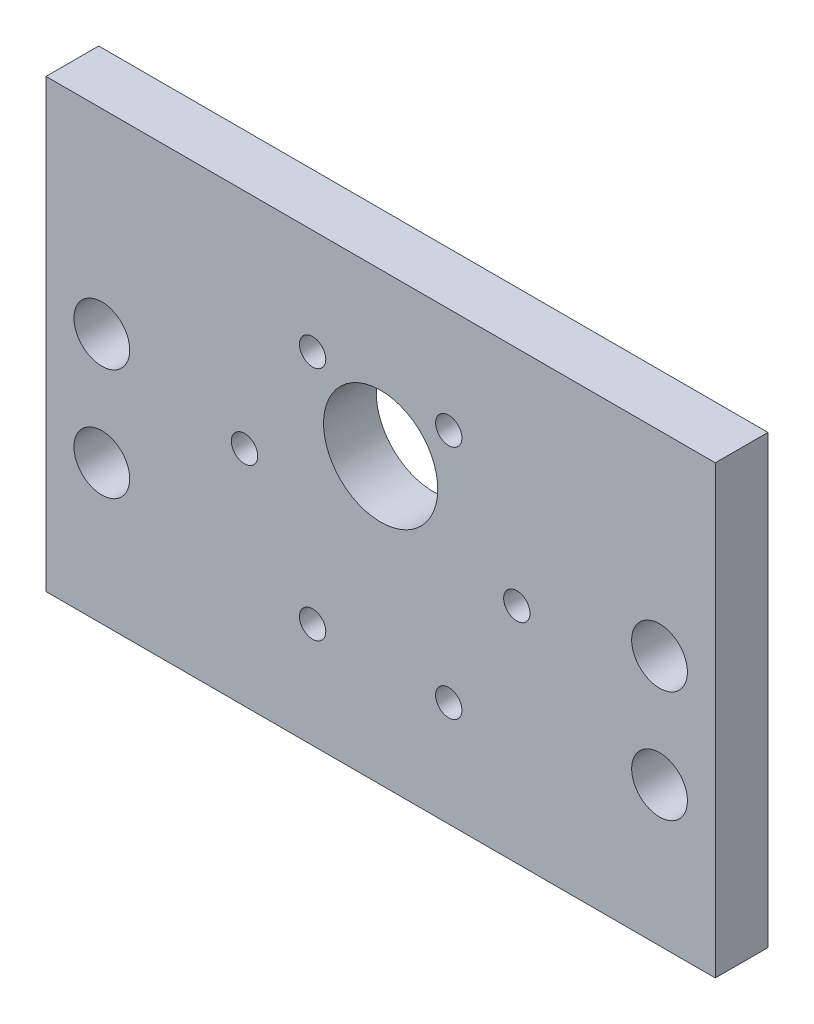
ISO-10303-21;
HEADER;
FILE_DESCRIPTION(('STEP AP214'),'2;1');
FILE_NAME('part.step','',(''),(''),'','','');
FILE_SCHEMA(('AUTOMOTIVE_DESIGN { 1 0 10303 214 1 1 1 1 }'));
ENDSEC;
DATA;
#1=APPLICATION_CONTEXT('core data for automotive mechanical design processes');
#2=APPLICATION_PROTOCOL_DEFINITION('international standard','automotive_design',2000,#1);
#3=PRODUCT_CONTEXT('',#1,'mechanical');
#4=PRODUCT('Part','Part','',(#3));
#5=PRODUCT_RELATED_PRODUCT_CATEGORY('part','',(#4));
#6=PRODUCT_DEFINITION_FORMATION('','',#4);
#7=PRODUCT_DEFINITION_CONTEXT('part definition',#1,'design');
#8=PRODUCT_DEFINITION('design','',#6,#7);
#9=PRODUCT_DEFINITION_SHAPE('','',#8);
#10=(LENGTH_UNIT() NAMED_UNIT(*) SI_UNIT(.MILLI.,.METRE.));
#11=(NAMED_UNIT(*) PLANE_ANGLE_UNIT() SI_UNIT($,.RADIAN.));
#12=(NAMED_UNIT(*) SI_UNIT($,.STERADIAN.) SOLID_ANGLE_UNIT());
#13=UNCERTAINTY_MEASURE_WITH_UNIT(LENGTH_MEASURE(1.E-05),#10,'distance_accuracy_value','');
#14=(GEOMETRIC_REPRESENTATION_CONTEXT(3) GLOBAL_UNCERTAINTY_ASSIGNED_CONTEXT((#13)) GLOBAL_UNIT_ASSIGNED_CONTEXT((#10,
#11,#12)) REPRESENTATION_CONTEXT('',''));
#15=CARTESIAN_POINT('',(0.,0.,0.));
#16=DIRECTION('',(0.,0.,1.));
#17=DIRECTION('',(1.,0.,0.));
#18=AXIS2_PLACEMENT_3D('',#15,#16,#17);
#19=CARTESIAN_POINT('',(0.,0.,5.9944));
#20=DIRECTION('',(0.,0.,-1.));
#21=DIRECTION('',(-1.,0.,0.));
#22=AXIS2_PLACEMENT_3D('',#19,#20,#21);
#23=PLANE('',#22);
#24=CARTESIAN_POINT('',(69.85,28.575,5.9944));
#25=DIRECTION('',(0.,0.,1.));
#26=DIRECTION('',(1.,0.,0.));
#27=AXIS2_PLACEMENT_3D('',#24,#25,#26);
#28=CIRCLE('',#27,3.175);
#29=CARTESIAN_POINT('',(73.025,28.575,5.9944));
#30=VERTEX_POINT('',#29);
#31=EDGE_CURVE('E164',#30,#30,#28,.T.);
#32=ORIENTED_EDGE('',*,*,#31,.F.);
#33=EDGE_LOOP('',(#32));
#34=FACE_BOUND('',#33,.T.);
#35=CARTESIAN_POINT('',(45.85,38.8233937586588,5.9944));
#36=DIRECTION('',(0.,0.,1.));
#37=DIRECTION('',(1.,0.,0.));
#38=AXIS2_PLACEMENT_3D('',#35,#36,#37);
#39=CIRCLE('',#38,1.50000000000001);
#40=CARTESIAN_POINT('',(47.35,38.8233937586588,5.9944));
#41=VERTEX_POINT('',#40);
#42=EDGE_CURVE('E152',#41,#41,#39,.T.);
#43=ORIENTED_EDGE('',*,*,#42,.F.);
#44=EDGE_LOOP('',(#43));
#45=FACE_BOUND('',#44,.T.);
#46=CARTESIAN_POINT('',(30.35,11.9766062413412,5.9944));
#47=DIRECTION('',(0.,0.,1.));
#48=DIRECTION('',(1.,0.,0.));
#49=AXIS2_PLACEMENT_3D('',#46,#47,#48);
#50=CIRCLE('',#49,1.50000000000001);
#51=CARTESIAN_POINT('',(31.85,11.9766062413412,5.9944));
#52=VERTEX_POINT('',#51);
#53=EDGE_CURVE('E140',#52,#52,#50,.T.);
#54=ORIENTED_EDGE('',*,*,#53,.F.);
#55=EDGE_LOOP('',(#54));
#56=FACE_BOUND('',#55,.T.);
#57=CARTESIAN_POINT('',(53.6,25.4,5.9944));
#58=DIRECTION('',(0.,0.,1.));
#59=DIRECTION('',(1.,0.,0.));
#60=AXIS2_PLACEMENT_3D('',#57,#58,#59);
#61=CIRCLE('',#60,1.5);
#62=CARTESIAN_POINT('',(55.1,25.4,5.9944));
#63=VERTEX_POINT('',#62);
#64=EDGE_CURVE('E128',#63,#63,#61,.T.);
#65=ORIENTED_EDGE('',*,*,#64,.F.);
#66=EDGE_LOOP('',(#65));
#67=FACE_BOUND('',#66,.T.);
#68=CARTESIAN_POINT('',(38.1,32.4,5.9944));
#69=DIRECTION('',(0.,0.,1.));
#70=DIRECTION('',(1.,0.,0.));
#71=AXIS2_PLACEMENT_3D('',#68,#69,#70);
#72=CIRCLE('',#71,6.50000000000002);
#73=CARTESIAN_POINT('',(44.6,32.4,5.9944));
#74=VERTEX_POINT('',#73);
#75=EDGE_CURVE('E116',#74,#74,#72,.T.);
#76=ORIENTED_EDGE('',*,*,#75,.F.);
#77=EDGE_LOOP('',(#76));
#78=FACE_BOUND('',#77,.T.);
#79=DIRECTION('',(0.,-1.,0.));
#80=VECTOR('',#79,1.);
#81=CARTESIAN_POINT('',(0.,0.,5.9944));
#82=LINE('',#81,#80);
#83=CARTESIAN_POINT('',(0.,50.8,5.9944));
#84=VERTEX_POINT('',#83);
#85=CARTESIAN_POINT('',(0.,0.,5.9944));
#86=VERTEX_POINT('',#85);
#87=EDGE_CURVE('E86',#84,#86,#82,.T.);
#88=ORIENTED_EDGE('',*,*,#87,.T.);
#89=DIRECTION('',(1.,0.,0.));
#90=VECTOR('',#89,1.);
#91=CARTESIAN_POINT('',(0.,0.,5.9944));
#92=LINE('',#91,#90);
#93=CARTESIAN_POINT('',(76.2,0.,5.9944));
#94=VERTEX_POINT('',#93);
#95=EDGE_CURVE('E81',#86,#94,#92,.T.);
#96=ORIENTED_EDGE('',*,*,#95,.T.);
#97=DIRECTION('',(0.,1.,0.));
#98=VECTOR('',#97,1.);
#99=CARTESIAN_POINT('',(76.2,0.,5.9944));
#100=LINE('',#99,#98);
#101=CARTESIAN_POINT('',(76.2,50.8,5.9944));
#102=VERTEX_POINT('',#101);
#103=EDGE_CURVE('E84',#94,#102,#100,.T.);
#104=ORIENTED_EDGE('',*,*,#103,.T.);
#105=DIRECTION('',(-1.,0.,0.));
#106=VECTOR('',#105,1.);
#107=CARTESIAN_POINT('',(0.,50.8,5.9944));
#108=LINE('',#107,#106);
#109=EDGE_CURVE('E51',#102,#84,#108,.T.);
#110=ORIENTED_EDGE('',*,*,#109,.T.);
#111=EDGE_LOOP('',(#88,#96,#104,#110));
#112=FACE_BOUND('',#111,.T.);
#113=CARTESIAN_POINT('',(6.35,28.575,5.9944));
#114=DIRECTION('',(0.,0.,1.));
#115=DIRECTION('',(1.,0.,0.));
#116=AXIS2_PLACEMENT_3D('',#113,#114,#115);
#117=CIRCLE('',#116,3.175);
#118=CARTESIAN_POINT('',(9.525,28.575,5.9944));
#119=VERTEX_POINT('',#118);
#120=EDGE_CURVE('E101',#119,#119,#117,.T.);
#121=ORIENTED_EDGE('',*,*,#120,.F.);
#122=EDGE_LOOP('',(#121));
#123=FACE_BOUND('',#122,.T.);
#124=CARTESIAN_POINT('',(22.6,25.4,5.9944));
#125=DIRECTION('',(0.,0.,1.));
#126=DIRECTION('',(1.,0.,0.));
#127=AXIS2_PLACEMENT_3D('',#124,#125,#126);
#128=CIRCLE('',#127,1.5);
#129=CARTESIAN_POINT('',(24.1,25.4,5.9944));
#130=VERTEX_POINT('',#129);
#131=EDGE_CURVE('E122',#130,#130,#128,.T.);
#132=ORIENTED_EDGE('',*,*,#131,.F.);
#133=EDGE_LOOP('',(#132));
#134=FACE_BOUND('',#133,.T.);
#135=CARTESIAN_POINT('',(45.85,11.9766062413412,5.9944));
#136=DIRECTION('',(0.,0.,1.));
#137=DIRECTION('',(1.,0.,0.));
#138=AXIS2_PLACEMENT_3D('',#135,#136,#137);
#139=CIRCLE('',#138,1.5);
#140=CARTESIAN_POINT('',(47.35,11.9766062413412,5.9944));
#141=VERTEX_POINT('',#140);
#142=EDGE_CURVE('E134',#141,#141,#139,.T.);
#143=ORIENTED_EDGE('',*,*,#142,.F.);
#144=EDGE_LOOP('',(#143));
#145=FACE_BOUND('',#144,.T.);
#146=CARTESIAN_POINT('',(30.35,38.8233937586588,5.9944));
#147=DIRECTION('',(0.,0.,1.));
#148=DIRECTION('',(1.,0.,0.));
#149=AXIS2_PLACEMENT_3D('',#146,#147,#148);
#150=CIRCLE('',#149,1.50000000000001);
#151=CARTESIAN_POINT('',(31.85,38.8233937586588,5.9944));
#152=VERTEX_POINT('',#151);
#153=EDGE_CURVE('E146',#152,#152,#150,.T.);
#154=ORIENTED_EDGE('',*,*,#153,.F.);
#155=EDGE_LOOP('',(#154));
#156=FACE_BOUND('',#155,.T.);
#157=CARTESIAN_POINT('',(6.35,15.875,5.9944));
#158=DIRECTION('',(0.,0.,1.));
#159=DIRECTION('',(1.,0.,0.));
#160=AXIS2_PLACEMENT_3D('',#157,#158,#159);
#161=CIRCLE('',#160,3.175);
#162=CARTESIAN_POINT('',(9.525,15.875,5.9944));
#163=VERTEX_POINT('',#162);
#164=EDGE_CURVE('E158',#163,#163,#161,.T.);
#165=ORIENTED_EDGE('',*,*,#164,.F.);
#166=EDGE_LOOP('',(#165));
#167=FACE_BOUND('',#166,.T.);
#168=CARTESIAN_POINT('',(69.85,15.875,5.9944));
#169=DIRECTION('',(0.,0.,1.));
#170=DIRECTION('',(1.,0.,0.));
#171=AXIS2_PLACEMENT_3D('',#168,#169,#170);
#172=CIRCLE('',#171,3.175);
#173=CARTESIAN_POINT('',(73.025,15.875,5.9944));
#174=VERTEX_POINT('',#173);
#175=EDGE_CURVE('E170',#174,#174,#172,.T.);
#176=ORIENTED_EDGE('',*,*,#175,.F.);
#177=EDGE_LOOP('',(#176));
#178=FACE_BOUND('',#177,.T.);
#179=ADVANCED_FACE('F34',(#34,#45,#56,#67,#78,#112,#123,#134,#145,#156,#167,#178),#23,.F.);
#180=CARTESIAN_POINT('',(0.,0.,0.));
#181=DIRECTION('',(0.,0.,-1.));
#182=DIRECTION('',(-1.,0.,0.));
#183=AXIS2_PLACEMENT_3D('',#180,#181,#182);
#184=PLANE('',#183);
#185=CARTESIAN_POINT('',(69.85,28.575,0.));
#186=DIRECTION('',(0.,0.,1.));
#187=DIRECTION('',(1.,0.,0.));
#188=AXIS2_PLACEMENT_3D('',#185,#186,#187);
#189=CIRCLE('',#188,3.175);
#190=CARTESIAN_POINT('',(73.025,28.575,0.));
#191=VERTEX_POINT('',#190);
#192=EDGE_CURVE('E167',#191,#191,#189,.T.);
#193=ORIENTED_EDGE('',*,*,#192,.T.);
#194=EDGE_LOOP('',(#193));
#195=FACE_BOUND('',#194,.T.);
#196=CARTESIAN_POINT('',(45.85,38.8233937586588,0.));
#197=DIRECTION('',(0.,0.,1.));
#198=DIRECTION('',(1.,0.,0.));
#199=AXIS2_PLACEMENT_3D('',#196,#197,#198);
#200=CIRCLE('',#199,1.50000000000001);
#201=CARTESIAN_POINT('',(47.35,38.8233937586588,0.));
#202=VERTEX_POINT('',#201);
#203=EDGE_CURVE('E155',#202,#202,#200,.T.);
#204=ORIENTED_EDGE('',*,*,#203,.T.);
#205=EDGE_LOOP('',(#204));
#206=FACE_BOUND('',#205,.T.);
#207=CARTESIAN_POINT('',(30.35,11.9766062413412,0.));
#208=DIRECTION('',(0.,0.,1.));
#209=DIRECTION('',(1.,0.,0.));
#210=AXIS2_PLACEMENT_3D('',#207,#208,#209);
#211=CIRCLE('',#210,1.50000000000001);
#212=CARTESIAN_POINT('',(31.85,11.9766062413412,0.));
#213=VERTEX_POINT('',#212);
#214=EDGE_CURVE('E143',#213,#213,#211,.T.);
#215=ORIENTED_EDGE('',*,*,#214,.T.);
#216=EDGE_LOOP('',(#215));
#217=FACE_BOUND('',#216,.T.);
#218=CARTESIAN_POINT('',(53.6,25.4,0.));
#219=DIRECTION('',(0.,0.,1.));
#220=DIRECTION('',(1.,0.,0.));
#221=AXIS2_PLACEMENT_3D('',#218,#219,#220);
#222=CIRCLE('',#221,1.5);
#223=CARTESIAN_POINT('',(55.1,25.4,0.));
#224=VERTEX_POINT('',#223);
#225=EDGE_CURVE('E131',#224,#224,#222,.T.);
#226=ORIENTED_EDGE('',*,*,#225,.T.);
#227=EDGE_LOOP('',(#226));
#228=FACE_BOUND('',#227,.T.);
#229=CARTESIAN_POINT('',(38.1,32.4,0.));
#230=DIRECTION('',(0.,0.,1.));
#231=DIRECTION('',(1.,0.,0.));
#232=AXIS2_PLACEMENT_3D('',#229,#230,#231);
#233=CIRCLE('',#232,6.50000000000002);
#234=CARTESIAN_POINT('',(44.6,32.4,0.));
#235=VERTEX_POINT('',#234);
#236=EDGE_CURVE('E119',#235,#235,#233,.T.);
#237=ORIENTED_EDGE('',*,*,#236,.T.);
#238=EDGE_LOOP('',(#237));
#239=FACE_BOUND('',#238,.T.);
#240=DIRECTION('',(0.,-1.,0.));
#241=VECTOR('',#240,1.);
#242=CARTESIAN_POINT('',(0.,0.,0.));
#243=LINE('',#242,#241);
#244=CARTESIAN_POINT('',(0.,50.8,0.));
#245=VERTEX_POINT('',#244);
#246=CARTESIAN_POINT('',(0.,0.,0.));
#247=VERTEX_POINT('',#246);
#248=EDGE_CURVE('E98',#245,#247,#243,.T.);
#249=ORIENTED_EDGE('',*,*,#248,.F.);
#250=DIRECTION('',(-1.,0.,0.));
#251=VECTOR('',#250,1.);
#252=CARTESIAN_POINT('',(0.,50.8,0.));
#253=LINE('',#252,#251);
#254=CARTESIAN_POINT('',(76.2,50.8,0.));
#255=VERTEX_POINT('',#254);
#256=EDGE_CURVE('E74',#255,#245,#253,.T.);
#257=ORIENTED_EDGE('',*,*,#256,.F.);
#258=DIRECTION('',(0.,1.,0.));
#259=VECTOR('',#258,1.);
#260=CARTESIAN_POINT('',(76.2,0.,0.));
#261=LINE('',#260,#259);
#262=CARTESIAN_POINT('',(76.2,0.,0.));
#263=VERTEX_POINT('',#262);
#264=EDGE_CURVE('E68',#263,#255,#261,.T.);
#265=ORIENTED_EDGE('',*,*,#264,.F.);
#266=DIRECTION('',(1.,0.,0.));
#267=VECTOR('',#266,1.);
#268=CARTESIAN_POINT('',(0.,0.,0.));
#269=LINE('',#268,#267);
#270=EDGE_CURVE('E90',#247,#263,#269,.T.);
#271=ORIENTED_EDGE('',*,*,#270,.F.);
#272=EDGE_LOOP('',(#249,#257,#265,#271));
#273=FACE_BOUND('',#272,.T.);
#274=CARTESIAN_POINT('',(6.35,28.575,0.));
#275=DIRECTION('',(0.,0.,1.));
#276=DIRECTION('',(1.,0.,0.));
#277=AXIS2_PLACEMENT_3D('',#274,#275,#276);
#278=CIRCLE('',#277,3.175);
#279=CARTESIAN_POINT('',(9.525,28.575,0.));
#280=VERTEX_POINT('',#279);
#281=EDGE_CURVE('E113',#280,#280,#278,.T.);
#282=ORIENTED_EDGE('',*,*,#281,.T.);
#283=EDGE_LOOP('',(#282));
#284=FACE_BOUND('',#283,.T.);
#285=CARTESIAN_POINT('',(22.6,25.4,0.));
#286=DIRECTION('',(0.,0.,1.));
#287=DIRECTION('',(1.,0.,0.));
#288=AXIS2_PLACEMENT_3D('',#285,#286,#287);
#289=CIRCLE('',#288,1.5);
#290=CARTESIAN_POINT('',(24.1,25.4,0.));
#291=VERTEX_POINT('',#290);
#292=EDGE_CURVE('E125',#291,#291,#289,.T.);
#293=ORIENTED_EDGE('',*,*,#292,.T.);
#294=EDGE_LOOP('',(#293));
#295=FACE_BOUND('',#294,.T.);
#296=CARTESIAN_POINT('',(45.85,11.9766062413412,0.));
#297=DIRECTION('',(0.,0.,1.));
#298=DIRECTION('',(1.,0.,0.));
#299=AXIS2_PLACEMENT_3D('',#296,#297,#298);
#300=CIRCLE('',#299,1.5);
#301=CARTESIAN_POINT('',(47.35,11.9766062413412,0.));
#302=VERTEX_POINT('',#301);
#303=EDGE_CURVE('E137',#302,#302,#300,.T.);
#304=ORIENTED_EDGE('',*,*,#303,.T.);
#305=EDGE_LOOP('',(#304));
#306=FACE_BOUND('',#305,.T.);
#307=CARTESIAN_POINT('',(30.35,38.8233937586588,0.));
#308=DIRECTION('',(0.,0.,1.));
#309=DIRECTION('',(1.,0.,0.));
#310=AXIS2_PLACEMENT_3D('',#307,#308,#309);
#311=CIRCLE('',#310,1.50000000000001);
#312=CARTESIAN_POINT('',(31.85,38.8233937586588,0.));
#313=VERTEX_POINT('',#312);
#314=EDGE_CURVE('E149',#313,#313,#311,.T.);
#315=ORIENTED_EDGE('',*,*,#314,.T.);
#316=EDGE_LOOP('',(#315));
#317=FACE_BOUND('',#316,.T.);
#318=CARTESIAN_POINT('',(6.35,15.875,0.));
#319=DIRECTION('',(0.,0.,1.));
#320=DIRECTION('',(1.,0.,0.));
#321=AXIS2_PLACEMENT_3D('',#318,#319,#320);
#322=CIRCLE('',#321,3.175);
#323=CARTESIAN_POINT('',(9.525,15.875,0.));
#324=VERTEX_POINT('',#323);
#325=EDGE_CURVE('E161',#324,#324,#322,.T.);
#326=ORIENTED_EDGE('',*,*,#325,.T.);
#327=EDGE_LOOP('',(#326));
#328=FACE_BOUND('',#327,.T.);
#329=CARTESIAN_POINT('',(69.85,15.875,0.));
#330=DIRECTION('',(0.,0.,1.));
#331=DIRECTION('',(1.,0.,0.));
#332=AXIS2_PLACEMENT_3D('',#329,#330,#331);
#333=CIRCLE('',#332,3.175);
#334=CARTESIAN_POINT('',(73.025,15.875,0.));
#335=VERTEX_POINT('',#334);
#336=EDGE_CURVE('E173',#335,#335,#333,.T.);
#337=ORIENTED_EDGE('',*,*,#336,.T.);
#338=EDGE_LOOP('',(#337));
#339=FACE_BOUND('',#338,.T.);
#340=ADVANCED_FACE('F109',(#195,#206,#217,#228,#239,#273,#284,#295,#306,#317,#328,#339),#184,.T.);
#341=CARTESIAN_POINT('',(0.,0.,5.9944));
#342=DIRECTION('',(1.,0.,0.));
#343=DIRECTION('',(0.,0.,-1.));
#344=AXIS2_PLACEMENT_3D('',#341,#342,#343);
#345=PLANE('',#344);
#346=ORIENTED_EDGE('',*,*,#248,.T.);
#347=DIRECTION('',(0.,0.,-1.));
#348=VECTOR('',#347,1.);
#349=CARTESIAN_POINT('',(0.,0.,5.9944));
#350=LINE('',#349,#348);
#351=EDGE_CURVE('E11',#86,#247,#350,.T.);
#352=ORIENTED_EDGE('',*,*,#351,.F.);
#353=ORIENTED_EDGE('',*,*,#87,.F.);
#354=DIRECTION('',(0.,0.,-1.));
#355=VECTOR('',#354,1.);
#356=CARTESIAN_POINT('',(0.,50.8,5.9944));
#357=LINE('',#356,#355);
#358=EDGE_CURVE('E94',#84,#245,#357,.T.);
#359=ORIENTED_EDGE('',*,*,#358,.T.);
#360=EDGE_LOOP('',(#346,#352,#353,#359));
#361=FACE_BOUND('',#360,.T.);
#362=ADVANCED_FACE('F36',(#361),#345,.F.);
#363=CARTESIAN_POINT('',(0.,0.,5.9944));
#364=DIRECTION('',(0.,1.,0.));
#365=DIRECTION('',(-1.,0.,0.));
#366=AXIS2_PLACEMENT_3D('',#363,#364,#365);
#367=PLANE('',#366);
#368=ORIENTED_EDGE('',*,*,#270,.T.);
#369=DIRECTION('',(0.,0.,-1.));
#370=VECTOR('',#369,1.);
#371=CARTESIAN_POINT('',(76.2,0.,5.9944));
#372=LINE('',#371,#370);
#373=EDGE_CURVE('E43',#94,#263,#372,.T.);
#374=ORIENTED_EDGE('',*,*,#373,.F.);
#375=ORIENTED_EDGE('',*,*,#95,.F.);
#376=ORIENTED_EDGE('',*,*,#351,.T.);
#377=EDGE_LOOP('',(#368,#374,#375,#376));
#378=FACE_BOUND('',#377,.T.);
#379=ADVANCED_FACE('F89',(#378),#367,.F.);
#380=CARTESIAN_POINT('',(76.2,0.,5.9944));
#381=DIRECTION('',(-1.,0.,0.));
#382=DIRECTION('',(0.,-1.,0.));
#383=AXIS2_PLACEMENT_3D('',#380,#381,#382);
#384=PLANE('',#383);
#385=ORIENTED_EDGE('',*,*,#264,.T.);
#386=DIRECTION('',(0.,0.,-1.));
#387=VECTOR('',#386,1.);
#388=CARTESIAN_POINT('',(76.2,50.8,5.9944));
#389=LINE('',#388,#387);
#390=EDGE_CURVE('E91',#102,#255,#389,.T.);
#391=ORIENTED_EDGE('',*,*,#390,.F.);
#392=ORIENTED_EDGE('',*,*,#103,.F.);
#393=ORIENTED_EDGE('',*,*,#373,.T.);
#394=EDGE_LOOP('',(#385,#391,#392,#393));
#395=FACE_BOUND('',#394,.T.);
#396=ADVANCED_FACE('F92',(#395),#384,.F.);
#397=CARTESIAN_POINT('',(0.,50.8,5.9944));
#398=DIRECTION('',(0.,-1.,0.));
#399=DIRECTION('',(1.,0.,0.));
#400=AXIS2_PLACEMENT_3D('',#397,#398,#399);
#401=PLANE('',#400);
#402=ORIENTED_EDGE('',*,*,#256,.T.);
#403=ORIENTED_EDGE('',*,*,#358,.F.);
#404=ORIENTED_EDGE('',*,*,#109,.F.);
#405=ORIENTED_EDGE('',*,*,#390,.T.);
#406=EDGE_LOOP('',(#402,#403,#404,#405));
#407=FACE_BOUND('',#406,.T.);
#408=ADVANCED_FACE('F106',(#407),#401,.F.);
#409=CARTESIAN_POINT('',(6.35,28.575,5.9944));
#410=DIRECTION('',(0.,0.,-1.));
#411=DIRECTION('',(-1.,0.,0.));
#412=AXIS2_PLACEMENT_3D('',#409,#410,#411);
#413=CYLINDRICAL_SURFACE('',#412,3.175);
#414=ORIENTED_EDGE('',*,*,#120,.T.);
#415=EDGE_LOOP('',(#414));
#416=FACE_BOUND('',#415,.T.);
#417=ORIENTED_EDGE('',*,*,#281,.F.);
#418=EDGE_LOOP('',(#417));
#419=FACE_BOUND('',#418,.T.);
#420=ADVANCED_FACE('F193',(#416,#419),#413,.F.);
#421=CARTESIAN_POINT('',(38.1,32.4,5.9944));
#422=DIRECTION('',(0.,0.,-1.));
#423=DIRECTION('',(-1.,0.,0.));
#424=AXIS2_PLACEMENT_3D('',#421,#422,#423);
#425=CYLINDRICAL_SURFACE('',#424,6.50000000000002);
#426=ORIENTED_EDGE('',*,*,#75,.T.);
#427=EDGE_LOOP('',(#426));
#428=FACE_BOUND('',#427,.T.);
#429=ORIENTED_EDGE('',*,*,#236,.F.);
#430=EDGE_LOOP('',(#429));
#431=FACE_BOUND('',#430,.T.);
#432=ADVANCED_FACE('F239',(#428,#431),#425,.F.);
#433=CARTESIAN_POINT('',(22.6,25.4,5.9944));
#434=DIRECTION('',(0.,0.,-1.));
#435=DIRECTION('',(-1.,0.,0.));
#436=AXIS2_PLACEMENT_3D('',#433,#434,#435);
#437=CYLINDRICAL_SURFACE('',#436,1.5);
#438=ORIENTED_EDGE('',*,*,#131,.T.);
#439=EDGE_LOOP('',(#438));
#440=FACE_BOUND('',#439,.T.);
#441=ORIENTED_EDGE('',*,*,#292,.F.);
#442=EDGE_LOOP('',(#441));
#443=FACE_BOUND('',#442,.T.);
#444=ADVANCED_FACE('F247',(#440,#443),#437,.F.);
#445=CARTESIAN_POINT('',(53.6,25.4,5.9944));
#446=DIRECTION('',(0.,0.,-1.));
#447=DIRECTION('',(-1.,0.,0.));
#448=AXIS2_PLACEMENT_3D('',#445,#446,#447);
#449=CYLINDRICAL_SURFACE('',#448,1.5);
#450=ORIENTED_EDGE('',*,*,#64,.T.);
#451=EDGE_LOOP('',(#450));
#452=FACE_BOUND('',#451,.T.);
#453=ORIENTED_EDGE('',*,*,#225,.F.);
#454=EDGE_LOOP('',(#453));
#455=FACE_BOUND('',#454,.T.);
#456=ADVANCED_FACE('F255',(#452,#455),#449,.F.);
#457=CARTESIAN_POINT('',(45.85,11.9766062413412,5.9944));
#458=DIRECTION('',(0.,0.,-1.));
#459=DIRECTION('',(-1.,0.,0.));
#460=AXIS2_PLACEMENT_3D('',#457,#458,#459);
#461=CYLINDRICAL_SURFACE('',#460,1.5);
#462=ORIENTED_EDGE('',*,*,#142,.T.);
#463=EDGE_LOOP('',(#462));
#464=FACE_BOUND('',#463,.T.);
#465=ORIENTED_EDGE('',*,*,#303,.F.);
#466=EDGE_LOOP('',(#465));
#467=FACE_BOUND('',#466,.T.);
#468=ADVANCED_FACE('F264',(#464,#467),#461,.F.);
#469=CARTESIAN_POINT('',(30.35,11.9766062413412,5.9944));
#470=DIRECTION('',(0.,0.,-1.));
#471=DIRECTION('',(-1.,0.,0.));
#472=AXIS2_PLACEMENT_3D('',#469,#470,#471);
#473=CYLINDRICAL_SURFACE('',#472,1.50000000000001);
#474=ORIENTED_EDGE('',*,*,#53,.T.);
#475=EDGE_LOOP('',(#474));
#476=FACE_BOUND('',#475,.T.);
#477=ORIENTED_EDGE('',*,*,#214,.F.);
#478=EDGE_LOOP('',(#477));
#479=FACE_BOUND('',#478,.T.);
#480=ADVANCED_FACE('F273',(#476,#479),#473,.F.);
#481=CARTESIAN_POINT('',(30.35,38.8233937586588,5.9944));
#482=DIRECTION('',(0.,0.,-1.));
#483=DIRECTION('',(-1.,0.,0.));
#484=AXIS2_PLACEMENT_3D('',#481,#482,#483);
#485=CYLINDRICAL_SURFACE('',#484,1.50000000000001);
#486=ORIENTED_EDGE('',*,*,#153,.T.);
#487=EDGE_LOOP('',(#486));
#488=FACE_BOUND('',#487,.T.);
#489=ORIENTED_EDGE('',*,*,#314,.F.);
#490=EDGE_LOOP('',(#489));
#491=FACE_BOUND('',#490,.T.);
#492=ADVANCED_FACE('F282',(#488,#491),#485,.F.);
#493=CARTESIAN_POINT('',(45.85,38.8233937586588,5.9944));
#494=DIRECTION('',(0.,0.,-1.));
#495=DIRECTION('',(-1.,0.,0.));
#496=AXIS2_PLACEMENT_3D('',#493,#494,#495);
#497=CYLINDRICAL_SURFACE('',#496,1.50000000000001);
#498=ORIENTED_EDGE('',*,*,#42,.T.);
#499=EDGE_LOOP('',(#498));
#500=FACE_BOUND('',#499,.T.);
#501=ORIENTED_EDGE('',*,*,#203,.F.);
#502=EDGE_LOOP('',(#501));
#503=FACE_BOUND('',#502,.T.);
#504=ADVANCED_FACE('F291',(#500,#503),#497,.F.);
#505=CARTESIAN_POINT('',(6.35,15.875,5.9944));
#506=DIRECTION('',(0.,0.,-1.));
#507=DIRECTION('',(-1.,0.,0.));
#508=AXIS2_PLACEMENT_3D('',#505,#506,#507);
#509=CYLINDRICAL_SURFACE('',#508,3.175);
#510=ORIENTED_EDGE('',*,*,#164,.T.);
#511=EDGE_LOOP('',(#510));
#512=FACE_BOUND('',#511,.T.);
#513=ORIENTED_EDGE('',*,*,#325,.F.);
#514=EDGE_LOOP('',(#513));
#515=FACE_BOUND('',#514,.T.);
#516=ADVANCED_FACE('F300',(#512,#515),#509,.F.);
#517=CARTESIAN_POINT('',(69.85,28.575,5.9944));
#518=DIRECTION('',(0.,0.,-1.));
#519=DIRECTION('',(-1.,0.,0.));
#520=AXIS2_PLACEMENT_3D('',#517,#518,#519);
#521=CYLINDRICAL_SURFACE('',#520,3.175);
#522=ORIENTED_EDGE('',*,*,#31,.T.);
#523=EDGE_LOOP('',(#522));
#524=FACE_BOUND('',#523,.T.);
#525=ORIENTED_EDGE('',*,*,#192,.F.);
#526=EDGE_LOOP('',(#525));
#527=FACE_BOUND('',#526,.T.);
#528=ADVANCED_FACE('F309',(#524,#527),#521,.F.);
#529=CARTESIAN_POINT('',(69.85,15.875,5.9944));
#530=DIRECTION('',(0.,0.,-1.));
#531=DIRECTION('',(-1.,0.,0.));
#532=AXIS2_PLACEMENT_3D('',#529,#530,#531);
#533=CYLINDRICAL_SURFACE('',#532,3.175);
#534=ORIENTED_EDGE('',*,*,#175,.T.);
#535=EDGE_LOOP('',(#534));
#536=FACE_BOUND('',#535,.T.);
#537=ORIENTED_EDGE('',*,*,#336,.F.);
#538=EDGE_LOOP('',(#537));
#539=FACE_BOUND('',#538,.T.);
#540=ADVANCED_FACE('F179',(#536,#539),#533,.F.);
#541=CLOSED_SHELL('',(#179,#340,#362,#379,#396,#408,#420,#432,#444,#456,#468,#480,#492,#504,
#516,#528,#540));
#542=MANIFOLD_SOLID_BREP('B2',#541);
#543=ADVANCED_BREP_SHAPE_REPRESENTATION('',(#18,#542),#14);
#544=SHAPE_DEFINITION_REPRESENTATION(#9,#543);
ENDSEC;
END-ISO-10303-21;
